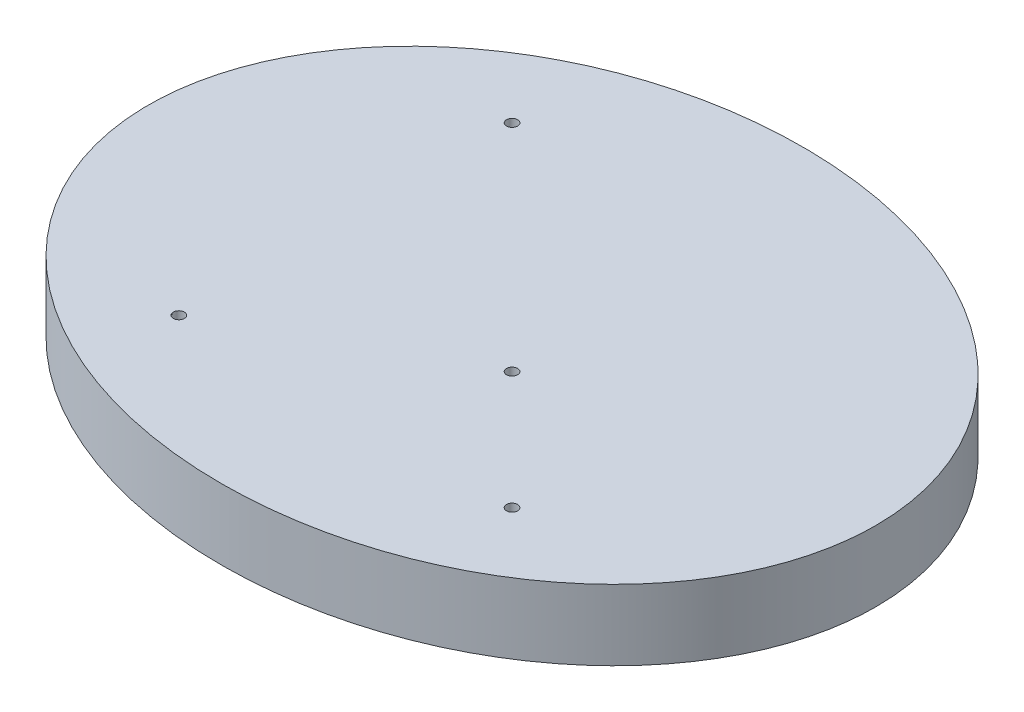
ISO-10303-21;
HEADER;
FILE_DESCRIPTION(('STEP AP214'),'2;1');
FILE_NAME('part.step','',(''),(''),'','','');
FILE_SCHEMA(('AUTOMOTIVE_DESIGN { 1 0 10303 214 1 1 1 1 }'));
ENDSEC;
DATA;
#1=APPLICATION_CONTEXT('core data for automotive mechanical design processes');
#2=APPLICATION_PROTOCOL_DEFINITION('international standard','automotive_design',2000,#1);
#3=PRODUCT_CONTEXT('',#1,'mechanical');
#4=PRODUCT('Part','Part','',(#3));
#5=PRODUCT_RELATED_PRODUCT_CATEGORY('part','',(#4));
#6=PRODUCT_DEFINITION_FORMATION('','',#4);
#7=PRODUCT_DEFINITION_CONTEXT('part definition',#1,'design');
#8=PRODUCT_DEFINITION('design','',#6,#7);
#9=PRODUCT_DEFINITION_SHAPE('','',#8);
#10=(LENGTH_UNIT() NAMED_UNIT(*) SI_UNIT(.MILLI.,.METRE.));
#11=(NAMED_UNIT(*) PLANE_ANGLE_UNIT() SI_UNIT($,.RADIAN.));
#12=(NAMED_UNIT(*) SI_UNIT($,.STERADIAN.) SOLID_ANGLE_UNIT());
#13=UNCERTAINTY_MEASURE_WITH_UNIT(LENGTH_MEASURE(1.E-05),#10,'distance_accuracy_value','');
#14=(GEOMETRIC_REPRESENTATION_CONTEXT(3) GLOBAL_UNCERTAINTY_ASSIGNED_CONTEXT((#13)) GLOBAL_UNIT_ASSIGNED_CONTEXT((#10,
#11,#12)) REPRESENTATION_CONTEXT('',''));
#15=CARTESIAN_POINT('',(0.,0.,0.));
#16=DIRECTION('',(0.,0.,1.));
#17=DIRECTION('',(1.,0.,0.));
#18=AXIS2_PLACEMENT_3D('',#15,#16,#17);
#19=CARTESIAN_POINT('',(0.,0.,0.));
#20=DIRECTION('',(0.,1.,0.));
#21=DIRECTION('',(0.,0.,1.));
#22=AXIS2_PLACEMENT_3D('',#19,#20,#21);
#23=PLANE('',#22);
#24=CARTESIAN_POINT('',(-30.,0.,30.));
#25=DIRECTION('',(0.,1.,0.));
#26=DIRECTION('',(0.,0.,1.));
#27=AXIS2_PLACEMENT_3D('',#24,#25,#26);
#28=CIRCLE('',#27,0.999999999999998);
#29=CARTESIAN_POINT('',(-30.,0.,31.));
#30=VERTEX_POINT('',#29);
#31=EDGE_CURVE('E58',#30,#30,#28,.T.);
#32=ORIENTED_EDGE('',*,*,#31,.T.);
#33=EDGE_LOOP('',(#32));
#34=FACE_BOUND('',#33,.T.);
#35=CARTESIAN_POINT('',(-30.,0.,-30.));
#36=DIRECTION('',(0.,1.,0.));
#37=DIRECTION('',(0.,0.,1.));
#38=AXIS2_PLACEMENT_3D('',#35,#36,#37);
#39=CIRCLE('',#38,0.999999999999998);
#40=CARTESIAN_POINT('',(-30.,0.,-29.));
#41=VERTEX_POINT('',#40);
#42=EDGE_CURVE('E46',#41,#41,#39,.T.);
#43=ORIENTED_EDGE('',*,*,#42,.T.);
#44=EDGE_LOOP('',(#43));
#45=FACE_BOUND('',#44,.T.);
#46=CARTESIAN_POINT('',(0.,0.,0.));
#47=DIRECTION('',(0.,1.,0.));
#48=DIRECTION('',(1.,0.,0.));
#49=AXIS2_PLACEMENT_3D('',#46,#47,#48);
#50=ELLIPSE('',#49,65.5330085889911,52.4264068711929);
#51=CARTESIAN_POINT('',(65.5330085889911,0.,0.));
#52=VERTEX_POINT('',#51);
#53=EDGE_CURVE('E39',#52,#52,#50,.T.);
#54=ORIENTED_EDGE('',*,*,#53,.F.);
#55=EDGE_LOOP('',(#54));
#56=FACE_BOUND('',#55,.T.);
#57=CARTESIAN_POINT('',(30.,0.,30.));
#58=DIRECTION('',(0.,1.,0.));
#59=DIRECTION('',(0.,0.,1.));
#60=AXIS2_PLACEMENT_3D('',#57,#58,#59);
#61=CIRCLE('',#60,0.999999999999998);
#62=CARTESIAN_POINT('',(30.,0.,31.));
#63=VERTEX_POINT('',#62);
#64=EDGE_CURVE('E52',#63,#63,#61,.T.);
#65=ORIENTED_EDGE('',*,*,#64,.T.);
#66=EDGE_LOOP('',(#65));
#67=FACE_BOUND('',#66,.T.);
#68=CARTESIAN_POINT('',(8.78679656440357,0.,8.78679656440358));
#69=DIRECTION('',(0.,1.,0.));
#70=DIRECTION('',(0.,0.,1.));
#71=AXIS2_PLACEMENT_3D('',#68,#69,#70);
#72=CIRCLE('',#71,1.);
#73=CARTESIAN_POINT('',(8.78679656440357,0.,9.78679656440358));
#74=VERTEX_POINT('',#73);
#75=EDGE_CURVE('E64',#74,#74,#72,.T.);
#76=ORIENTED_EDGE('',*,*,#75,.T.);
#77=EDGE_LOOP('',(#76));
#78=FACE_BOUND('',#77,.T.);
#79=ADVANCED_FACE('F31',(#34,#45,#56,#67,#78),#23,.F.);
#80=CARTESIAN_POINT('',(0.,12.7,0.));
#81=DIRECTION('',(0.,1.,0.));
#82=DIRECTION('',(0.,0.,1.));
#83=AXIS2_PLACEMENT_3D('',#80,#81,#82);
#84=PLANE('',#83);
#85=CARTESIAN_POINT('',(-30.,12.7,30.));
#86=DIRECTION('',(0.,1.,0.));
#87=DIRECTION('',(0.,0.,1.));
#88=AXIS2_PLACEMENT_3D('',#85,#86,#87);
#89=CIRCLE('',#88,0.999999999999998);
#90=CARTESIAN_POINT('',(-30.,12.7,31.));
#91=VERTEX_POINT('',#90);
#92=EDGE_CURVE('E55',#91,#91,#89,.T.);
#93=ORIENTED_EDGE('',*,*,#92,.F.);
#94=EDGE_LOOP('',(#93));
#95=FACE_BOUND('',#94,.T.);
#96=CARTESIAN_POINT('',(-30.,12.7,-30.));
#97=DIRECTION('',(0.,1.,0.));
#98=DIRECTION('',(0.,0.,1.));
#99=AXIS2_PLACEMENT_3D('',#96,#97,#98);
#100=CIRCLE('',#99,0.999999999999998);
#101=CARTESIAN_POINT('',(-30.,12.7,-29.));
#102=VERTEX_POINT('',#101);
#103=EDGE_CURVE('E43',#102,#102,#100,.T.);
#104=ORIENTED_EDGE('',*,*,#103,.F.);
#105=EDGE_LOOP('',(#104));
#106=FACE_BOUND('',#105,.T.);
#107=CARTESIAN_POINT('',(0.,12.7,0.));
#108=DIRECTION('',(0.,1.,0.));
#109=DIRECTION('',(1.,0.,0.));
#110=AXIS2_PLACEMENT_3D('',#107,#108,#109);
#111=ELLIPSE('',#110,65.5330085889911,52.4264068711929);
#112=CARTESIAN_POINT('',(65.5330085889911,12.7,0.));
#113=VERTEX_POINT('',#112);
#114=EDGE_CURVE('E10',#113,#113,#111,.T.);
#115=ORIENTED_EDGE('',*,*,#114,.T.);
#116=EDGE_LOOP('',(#115));
#117=FACE_BOUND('',#116,.T.);
#118=CARTESIAN_POINT('',(30.,12.7,30.));
#119=DIRECTION('',(0.,1.,0.));
#120=DIRECTION('',(0.,0.,1.));
#121=AXIS2_PLACEMENT_3D('',#118,#119,#120);
#122=CIRCLE('',#121,0.999999999999998);
#123=CARTESIAN_POINT('',(30.,12.7,31.));
#124=VERTEX_POINT('',#123);
#125=EDGE_CURVE('E49',#124,#124,#122,.T.);
#126=ORIENTED_EDGE('',*,*,#125,.F.);
#127=EDGE_LOOP('',(#126));
#128=FACE_BOUND('',#127,.T.);
#129=CARTESIAN_POINT('',(8.78679656440357,12.7,8.78679656440358));
#130=DIRECTION('',(0.,1.,0.));
#131=DIRECTION('',(0.,0.,1.));
#132=AXIS2_PLACEMENT_3D('',#129,#130,#131);
#133=CIRCLE('',#132,1.);
#134=CARTESIAN_POINT('',(8.78679656440357,12.7,9.78679656440358));
#135=VERTEX_POINT('',#134);
#136=EDGE_CURVE('E61',#135,#135,#133,.T.);
#137=ORIENTED_EDGE('',*,*,#136,.F.);
#138=EDGE_LOOP('',(#137));
#139=FACE_BOUND('',#138,.T.);
#140=ADVANCED_FACE('F33',(#95,#106,#117,#128,#139),#84,.T.);
#141=CARTESIAN_POINT('',(0.,180.546398259226,0.));
#142=DIRECTION('',(0.,1.,0.));
#143=DIRECTION('',(1.,0.,0.));
#144=AXIS2_PLACEMENT_3D('',#141,#142,#143);
#145=ELLIPSE('',#144,65.5330085889911,52.4264068711929);
#146=DIRECTION('',(0.,-1.,0.));
#147=VECTOR('',#146,1.);
#148=SURFACE_OF_LINEAR_EXTRUSION('',#145,#147);
#149=ORIENTED_EDGE('',*,*,#53,.T.);
#150=EDGE_LOOP('',(#149));
#151=FACE_BOUND('',#150,.T.);
#152=ORIENTED_EDGE('',*,*,#114,.F.);
#153=EDGE_LOOP('',(#152));
#154=FACE_BOUND('',#153,.T.);
#155=ADVANCED_FACE('F74',(#151,#154),#148,.F.);
#156=CARTESIAN_POINT('',(-30.,12.7,-30.));
#157=DIRECTION('',(0.,-1.,0.));
#158=DIRECTION('',(0.,0.,-1.));
#159=AXIS2_PLACEMENT_3D('',#156,#157,#158);
#160=CYLINDRICAL_SURFACE('',#159,0.999999999999998);
#161=ORIENTED_EDGE('',*,*,#103,.T.);
#162=EDGE_LOOP('',(#161));
#163=FACE_BOUND('',#162,.T.);
#164=ORIENTED_EDGE('',*,*,#42,.F.);
#165=EDGE_LOOP('',(#164));
#166=FACE_BOUND('',#165,.T.);
#167=ADVANCED_FACE('F80',(#163,#166),#160,.F.);
#168=CARTESIAN_POINT('',(30.,12.7,30.));
#169=DIRECTION('',(0.,-1.,0.));
#170=DIRECTION('',(0.,0.,-1.));
#171=AXIS2_PLACEMENT_3D('',#168,#169,#170);
#172=CYLINDRICAL_SURFACE('',#171,0.999999999999998);
#173=ORIENTED_EDGE('',*,*,#125,.T.);
#174=EDGE_LOOP('',(#173));
#175=FACE_BOUND('',#174,.T.);
#176=ORIENTED_EDGE('',*,*,#64,.F.);
#177=EDGE_LOOP('',(#176));
#178=FACE_BOUND('',#177,.T.);
#179=ADVANCED_FACE('F90',(#175,#178),#172,.F.);
#180=CARTESIAN_POINT('',(-30.,12.7,30.));
#181=DIRECTION('',(0.,-1.,0.));
#182=DIRECTION('',(0.,0.,-1.));
#183=AXIS2_PLACEMENT_3D('',#180,#181,#182);
#184=CYLINDRICAL_SURFACE('',#183,0.999999999999998);
#185=ORIENTED_EDGE('',*,*,#92,.T.);
#186=EDGE_LOOP('',(#185));
#187=FACE_BOUND('',#186,.T.);
#188=ORIENTED_EDGE('',*,*,#31,.F.);
#189=EDGE_LOOP('',(#188));
#190=FACE_BOUND('',#189,.T.);
#191=ADVANCED_FACE('F93',(#187,#190),#184,.F.);
#192=CARTESIAN_POINT('',(8.78679656440357,12.7,8.78679656440358));
#193=DIRECTION('',(0.,-1.,0.));
#194=DIRECTION('',(0.,0.,-1.));
#195=AXIS2_PLACEMENT_3D('',#192,#193,#194);
#196=CYLINDRICAL_SURFACE('',#195,1.);
#197=ORIENTED_EDGE('',*,*,#136,.T.);
#198=EDGE_LOOP('',(#197));
#199=FACE_BOUND('',#198,.T.);
#200=ORIENTED_EDGE('',*,*,#75,.F.);
#201=EDGE_LOOP('',(#200));
#202=FACE_BOUND('',#201,.T.);
#203=ADVANCED_FACE('F70',(#199,#202),#196,.F.);
#204=CLOSED_SHELL('',(#79,#140,#155,#167,#179,#191,#203));
#205=MANIFOLD_SOLID_BREP('B2',#204);
#206=ADVANCED_BREP_SHAPE_REPRESENTATION('',(#18,#205),#14);
#207=SHAPE_DEFINITION_REPRESENTATION(#9,#206);
ENDSEC;
END-ISO-10303-21;
